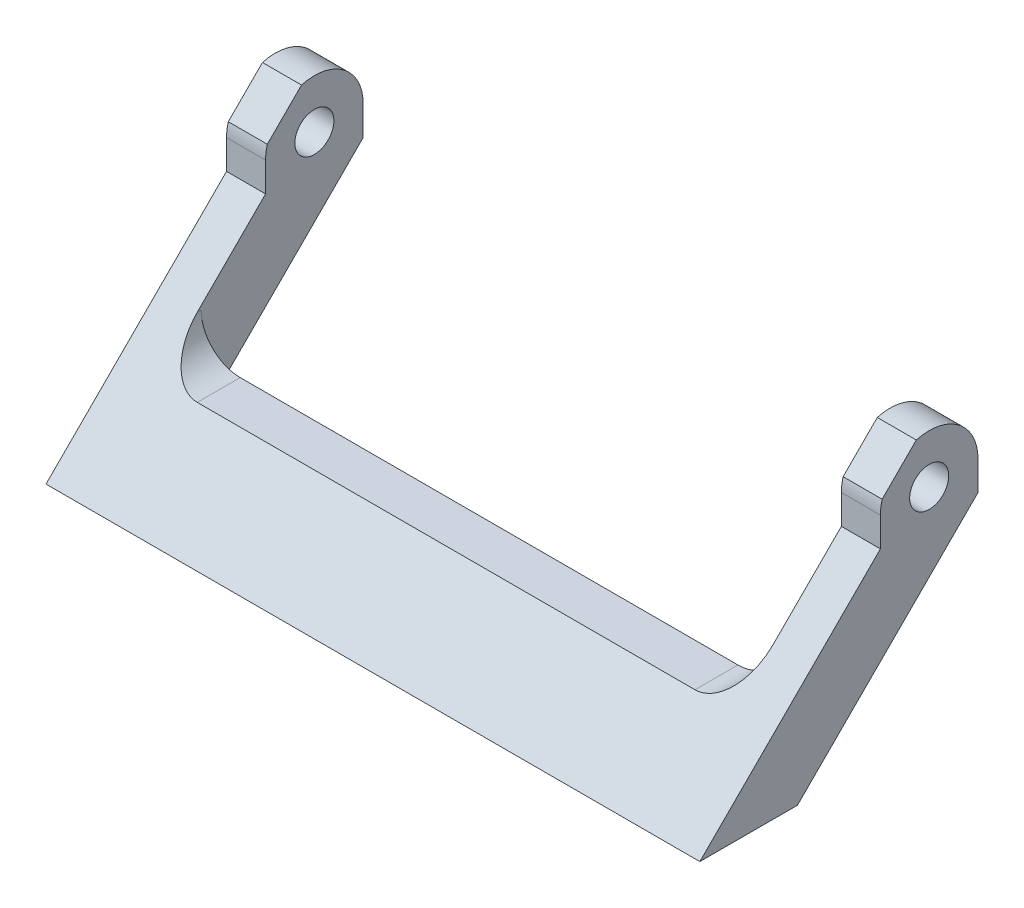
ISO-10303-21;
HEADER;
FILE_DESCRIPTION(('STEP AP214'),'2;1');
FILE_NAME('part.step','',(''),(''),'','','');
FILE_SCHEMA(('AUTOMOTIVE_DESIGN { 1 0 10303 214 1 1 1 1 }'));
ENDSEC;
DATA;
#1=APPLICATION_CONTEXT('core data for automotive mechanical design processes');
#2=APPLICATION_PROTOCOL_DEFINITION('international standard','automotive_design',2000,#1);
#3=PRODUCT_CONTEXT('',#1,'mechanical');
#4=PRODUCT('Part','Part','',(#3));
#5=PRODUCT_RELATED_PRODUCT_CATEGORY('part','',(#4));
#6=PRODUCT_DEFINITION_FORMATION('','',#4);
#7=PRODUCT_DEFINITION_CONTEXT('part definition',#1,'design');
#8=PRODUCT_DEFINITION('design','',#6,#7);
#9=PRODUCT_DEFINITION_SHAPE('','',#8);
#10=(LENGTH_UNIT() NAMED_UNIT(*) SI_UNIT(.MILLI.,.METRE.));
#11=(NAMED_UNIT(*) PLANE_ANGLE_UNIT() SI_UNIT($,.RADIAN.));
#12=(NAMED_UNIT(*) SI_UNIT($,.STERADIAN.) SOLID_ANGLE_UNIT());
#13=UNCERTAINTY_MEASURE_WITH_UNIT(LENGTH_MEASURE(1.E-05),#10,'distance_accuracy_value','');
#14=(GEOMETRIC_REPRESENTATION_CONTEXT(3) GLOBAL_UNCERTAINTY_ASSIGNED_CONTEXT((#13)) GLOBAL_UNIT_ASSIGNED_CONTEXT((#10,
#11,#12)) REPRESENTATION_CONTEXT('',''));
#15=CARTESIAN_POINT('',(0.,0.,0.));
#16=DIRECTION('',(0.,0.,1.));
#17=DIRECTION('',(1.,0.,0.));
#18=AXIS2_PLACEMENT_3D('',#15,#16,#17);
#19=CARTESIAN_POINT('',(67.,21.5,-23.5000000000002));
#20=DIRECTION('',(-1.,0.,0.));
#21=DIRECTION('',(0.,0.,1.));
#22=AXIS2_PLACEMENT_3D('',#19,#20,#21);
#23=CYLINDRICAL_SURFACE('',#22,5.);
#24=DIRECTION('',(-1.,0.,0.));
#25=VECTOR('',#24,1.);
#26=CARTESIAN_POINT('',(67.,26.3227933882397,-22.1806577645087));
#27=LINE('',#26,#25);
#28=CARTESIAN_POINT('',(4.,26.3227933882397,-22.1806577645088));
#29=VERTEX_POINT('',#28);
#30=CARTESIAN_POINT('',(0.,26.3227933882397,-22.1806577645087));
#31=VERTEX_POINT('',#30);
#32=EDGE_CURVE('E281',#29,#31,#27,.T.);
#33=ORIENTED_EDGE('',*,*,#32,.F.);
#34=CARTESIAN_POINT('',(4.,21.5,-23.5000000000002));
#35=DIRECTION('',(-1.,0.,0.));
#36=DIRECTION('',(0.,-1.,0.));
#37=AXIS2_PLACEMENT_3D('',#34,#35,#36);
#38=CIRCLE('',#37,5.);
#39=CARTESIAN_POINT('',(4.,21.5,-28.5000000000002));
#40=VERTEX_POINT('',#39);
#41=EDGE_CURVE('E283',#40,#29,#38,.F.);
#42=ORIENTED_EDGE('',*,*,#41,.F.);
#43=DIRECTION('',(-1.,0.,0.));
#44=VECTOR('',#43,1.);
#45=CARTESIAN_POINT('',(67.,21.5,-28.5000000000002));
#46=LINE('',#45,#44);
#47=CARTESIAN_POINT('',(0.,21.5,-28.5000000000002));
#48=VERTEX_POINT('',#47);
#49=EDGE_CURVE('E226',#40,#48,#46,.T.);
#50=ORIENTED_EDGE('',*,*,#49,.T.);
#51=CARTESIAN_POINT('',(0.,21.5,-23.5000000000002));
#52=DIRECTION('',(1.,0.,0.));
#53=DIRECTION('',(0.,0.,1.));
#54=AXIS2_PLACEMENT_3D('',#51,#52,#53);
#55=CIRCLE('',#54,5.);
#56=EDGE_CURVE('E204',#48,#31,#55,.T.);
#57=ORIENTED_EDGE('',*,*,#56,.T.);
#58=EDGE_LOOP('',(#33,#42,#50,#57));
#59=FACE_BOUND('',#58,.T.);
#60=ADVANCED_FACE('F33',(#59),#23,.T.);
#61=DIRECTION('',(-1.,0.,0.));
#62=VECTOR('',#61,1.);
#63=CARTESIAN_POINT('',(67.,22.8193422354914,-18.6772066117605));
#64=LINE('',#63,#62);
#65=CARTESIAN_POINT('',(0.,22.8193422354914,-18.6772066117605));
#66=VERTEX_POINT('',#65);
#67=CARTESIAN_POINT('',(4.,22.8193422354914,-18.6772066117605));
#68=VERTEX_POINT('',#67);
#69=EDGE_CURVE('E48',#66,#68,#64,.F.);
#70=ORIENTED_EDGE('',*,*,#69,.F.);
#71=CARTESIAN_POINT('',(0.,21.5,-18.5000000000002));
#72=VERTEX_POINT('',#71);
#73=EDGE_CURVE('E203',#66,#72,#55,.T.);
#74=ORIENTED_EDGE('',*,*,#73,.T.);
#75=DIRECTION('',(-1.,0.,0.));
#76=VECTOR('',#75,1.);
#77=CARTESIAN_POINT('',(67.,21.5,-18.5000000000002));
#78=LINE('',#77,#76);
#79=CARTESIAN_POINT('',(4.,21.5,-18.5000000000002));
#80=VERTEX_POINT('',#79);
#81=EDGE_CURVE('E222',#80,#72,#78,.T.);
#82=ORIENTED_EDGE('',*,*,#81,.F.);
#83=EDGE_CURVE('E276',#68,#80,#38,.F.);
#84=ORIENTED_EDGE('',*,*,#83,.F.);
#85=EDGE_LOOP('',(#70,#74,#82,#84));
#86=FACE_BOUND('',#85,.T.);
#87=ADVANCED_FACE('F275',(#86),#23,.T.);
#88=CARTESIAN_POINT('',(67.,21.5,-23.5000000000002));
#89=DIRECTION('',(-1.,0.,0.));
#90=DIRECTION('',(0.,0.,1.));
#91=AXIS2_PLACEMENT_3D('',#88,#89,#90);
#92=PLANE('',#91);
#93=CARTESIAN_POINT('',(67.,21.5,-23.5000000000002));
#94=DIRECTION('',(1.,0.,0.));
#95=DIRECTION('',(0.,0.,-1.));
#96=AXIS2_PLACEMENT_3D('',#93,#94,#95);
#97=CIRCLE('',#96,2.00000000000001);
#98=CARTESIAN_POINT('',(67.,21.5,-25.5000000000002));
#99=VERTEX_POINT('',#98);
#100=EDGE_CURVE('E200',#99,#99,#97,.T.);
#101=ORIENTED_EDGE('',*,*,#100,.F.);
#102=EDGE_LOOP('',(#101));
#103=FACE_BOUND('',#102,.T.);
#104=DIRECTION('',(0.,0.,-1.));
#105=VECTOR('',#104,1.);
#106=CARTESIAN_POINT('',(67.,0.,-11.9));
#107=LINE('',#106,#105);
#108=CARTESIAN_POINT('',(67.,0.,0.));
#109=VERTEX_POINT('',#108);
#110=CARTESIAN_POINT('',(67.,0.,-10.));
#111=VERTEX_POINT('',#110);
#112=EDGE_CURVE('E193',#109,#111,#107,.T.);
#113=ORIENTED_EDGE('',*,*,#112,.T.);
#114=DIRECTION('',(0.,0.707106781186544,-0.707106781186551));
#115=VECTOR('',#114,1.);
#116=CARTESIAN_POINT('',(67.,18.5,-28.5000000000002));
#117=LINE('',#116,#115);
#118=CARTESIAN_POINT('',(67.,18.5,-28.5000000000002));
#119=VERTEX_POINT('',#118);
#120=EDGE_CURVE('E215',#111,#119,#117,.T.);
#121=ORIENTED_EDGE('',*,*,#120,.T.);
#122=DIRECTION('',(0.,1.,0.));
#123=VECTOR('',#122,1.);
#124=CARTESIAN_POINT('',(67.,21.5,-28.5000000000002));
#125=LINE('',#124,#123);
#126=CARTESIAN_POINT('',(67.,21.5,-28.5000000000002));
#127=VERTEX_POINT('',#126);
#128=EDGE_CURVE('E182',#119,#127,#125,.T.);
#129=ORIENTED_EDGE('',*,*,#128,.T.);
#130=CARTESIAN_POINT('',(67.,21.5,-23.5000000000002));
#131=DIRECTION('',(1.,0.,0.));
#132=DIRECTION('',(0.,0.,1.));
#133=AXIS2_PLACEMENT_3D('',#130,#131,#132);
#134=CIRCLE('',#133,5.);
#135=CARTESIAN_POINT('',(67.,26.3227933882397,-22.1806577645087));
#136=VERTEX_POINT('',#135);
#137=EDGE_CURVE('E175',#127,#136,#134,.T.);
#138=ORIENTED_EDGE('',*,*,#137,.T.);
#139=DIRECTION('',(0.,-0.707106781186547,0.707106781186547));
#140=VECTOR('',#139,1.);
#141=CARTESIAN_POINT('',(67.,30.538773868803,-26.396638245072));
#142=LINE('',#141,#140);
#143=CARTESIAN_POINT('',(67.,22.8193422354914,-18.6772066117605));
#144=VERTEX_POINT('',#143);
#145=EDGE_CURVE('E161',#136,#144,#142,.T.);
#146=ORIENTED_EDGE('',*,*,#145,.T.);
#147=CARTESIAN_POINT('',(67.,21.5,-18.5000000000002));
#148=VERTEX_POINT('',#147);
#149=EDGE_CURVE('E185',#144,#148,#134,.T.);
#150=ORIENTED_EDGE('',*,*,#149,.T.);
#151=DIRECTION('',(0.,-1.,0.));
#152=VECTOR('',#151,1.);
#153=CARTESIAN_POINT('',(67.,18.5,-18.5000000000002));
#154=LINE('',#153,#152);
#155=CARTESIAN_POINT('',(67.,18.5,-18.5000000000002));
#156=VERTEX_POINT('',#155);
#157=EDGE_CURVE('E184',#148,#156,#154,.T.);
#158=ORIENTED_EDGE('',*,*,#157,.T.);
#159=DIRECTION('',(0.,-0.707106781186544,0.707106781186551));
#160=VECTOR('',#159,1.);
#161=CARTESIAN_POINT('',(67.,0.,0.));
#162=LINE('',#161,#160);
#163=EDGE_CURVE('E187',#156,#109,#162,.T.);
#164=ORIENTED_EDGE('',*,*,#163,.T.);
#165=EDGE_LOOP('',(#113,#121,#129,#138,#146,#150,#158,#164));
#166=FACE_BOUND('',#165,.T.);
#167=ADVANCED_FACE('F180',(#103,#166),#92,.F.);
#168=CARTESIAN_POINT('',(0.,21.5,-23.5000000000002));
#169=DIRECTION('',(-1.,0.,0.));
#170=DIRECTION('',(0.,0.,1.));
#171=AXIS2_PLACEMENT_3D('',#168,#169,#170);
#172=PLANE('',#171);
#173=CARTESIAN_POINT('',(0.,21.5,-23.5000000000002));
#174=DIRECTION('',(1.,0.,0.));
#175=DIRECTION('',(0.,0.,-1.));
#176=AXIS2_PLACEMENT_3D('',#173,#174,#175);
#177=CIRCLE('',#176,2.00000000000001);
#178=CARTESIAN_POINT('',(0.,21.5,-25.5000000000002));
#179=VERTEX_POINT('',#178);
#180=EDGE_CURVE('E329',#179,#179,#177,.T.);
#181=ORIENTED_EDGE('',*,*,#180,.T.);
#182=EDGE_LOOP('',(#181));
#183=FACE_BOUND('',#182,.T.);
#184=DIRECTION('',(0.,0.707106781186544,-0.707106781186551));
#185=VECTOR('',#184,1.);
#186=CARTESIAN_POINT('',(0.,18.5,-28.5000000000002));
#187=LINE('',#186,#185);
#188=CARTESIAN_POINT('',(0.,0.,-10.));
#189=VERTEX_POINT('',#188);
#190=CARTESIAN_POINT('',(0.,18.5,-28.5000000000002));
#191=VERTEX_POINT('',#190);
#192=EDGE_CURVE('E196',#189,#191,#187,.T.);
#193=ORIENTED_EDGE('',*,*,#192,.F.);
#194=DIRECTION('',(0.,0.,-1.));
#195=VECTOR('',#194,1.);
#196=CARTESIAN_POINT('',(0.,0.,-11.9));
#197=LINE('',#196,#195);
#198=CARTESIAN_POINT('',(0.,0.,0.));
#199=VERTEX_POINT('',#198);
#200=EDGE_CURVE('E212',#199,#189,#197,.T.);
#201=ORIENTED_EDGE('',*,*,#200,.F.);
#202=DIRECTION('',(0.,-0.707106781186544,0.707106781186551));
#203=VECTOR('',#202,1.);
#204=CARTESIAN_POINT('',(0.,0.,0.));
#205=LINE('',#204,#203);
#206=CARTESIAN_POINT('',(0.,18.5,-18.5000000000002));
#207=VERTEX_POINT('',#206);
#208=EDGE_CURVE('E210',#207,#199,#205,.T.);
#209=ORIENTED_EDGE('',*,*,#208,.F.);
#210=DIRECTION('',(0.,-1.,0.));
#211=VECTOR('',#210,1.);
#212=CARTESIAN_POINT('',(0.,18.5,-18.5000000000002));
#213=LINE('',#212,#211);
#214=EDGE_CURVE('E207',#72,#207,#213,.T.);
#215=ORIENTED_EDGE('',*,*,#214,.F.);
#216=ORIENTED_EDGE('',*,*,#73,.F.);
#217=DIRECTION('',(0.,-0.707106781186547,0.707106781186547));
#218=VECTOR('',#217,1.);
#219=CARTESIAN_POINT('',(0.,30.538773868803,-26.396638245072));
#220=LINE('',#219,#218);
#221=EDGE_CURVE('E168',#31,#66,#220,.T.);
#222=ORIENTED_EDGE('',*,*,#221,.F.);
#223=ORIENTED_EDGE('',*,*,#56,.F.);
#224=DIRECTION('',(0.,1.,0.));
#225=VECTOR('',#224,1.);
#226=CARTESIAN_POINT('',(0.,21.5,-28.5000000000002));
#227=LINE('',#226,#225);
#228=EDGE_CURVE('E199',#191,#48,#227,.T.);
#229=ORIENTED_EDGE('',*,*,#228,.F.);
#230=EDGE_LOOP('',(#193,#201,#209,#215,#216,#222,#223,#229));
#231=FACE_BOUND('',#230,.T.);
#232=ADVANCED_FACE('F244',(#183,#231),#172,.T.);
#233=DIRECTION('',(-1.,0.,0.));
#234=VECTOR('',#233,1.);
#235=CARTESIAN_POINT('',(67.,26.3227933882397,-22.1806577645087));
#236=LINE('',#235,#234);
#237=CARTESIAN_POINT('',(63.,26.3227933882397,-22.1806577645087));
#238=VERTEX_POINT('',#237);
#239=EDGE_CURVE('E55',#136,#238,#236,.T.);
#240=ORIENTED_EDGE('',*,*,#239,.F.);
#241=ORIENTED_EDGE('',*,*,#137,.F.);
#242=CARTESIAN_POINT('',(63.,21.5,-28.5000000000002));
#243=VERTEX_POINT('',#242);
#244=EDGE_CURVE('E227',#127,#243,#46,.T.);
#245=ORIENTED_EDGE('',*,*,#244,.T.);
#246=CARTESIAN_POINT('',(63.,21.5,-23.5000000000002));
#247=DIRECTION('',(1.,0.,0.));
#248=DIRECTION('',(0.,0.,-1.));
#249=AXIS2_PLACEMENT_3D('',#246,#247,#248);
#250=CIRCLE('',#249,5.);
#251=EDGE_CURVE('E176',#238,#243,#250,.F.);
#252=ORIENTED_EDGE('',*,*,#251,.F.);
#253=EDGE_LOOP('',(#240,#241,#245,#252));
#254=FACE_BOUND('',#253,.T.);
#255=ADVANCED_FACE('F173',(#254),#23,.T.);
#256=DIRECTION('',(-1.,0.,0.));
#257=VECTOR('',#256,1.);
#258=CARTESIAN_POINT('',(67.,22.8193422354914,-18.6772066117605));
#259=LINE('',#258,#257);
#260=CARTESIAN_POINT('',(63.,22.8193422354914,-18.6772066117605));
#261=VERTEX_POINT('',#260);
#262=EDGE_CURVE('E164',#261,#144,#259,.F.);
#263=ORIENTED_EDGE('',*,*,#262,.F.);
#264=CARTESIAN_POINT('',(63.,21.5,-18.5000000000002));
#265=VERTEX_POINT('',#264);
#266=EDGE_CURVE('E290',#265,#261,#250,.F.);
#267=ORIENTED_EDGE('',*,*,#266,.F.);
#268=EDGE_CURVE('E223',#148,#265,#78,.T.);
#269=ORIENTED_EDGE('',*,*,#268,.F.);
#270=ORIENTED_EDGE('',*,*,#149,.F.);
#271=EDGE_LOOP('',(#263,#267,#269,#270));
#272=FACE_BOUND('',#271,.T.);
#273=ADVANCED_FACE('F355',(#272),#23,.T.);
#274=CARTESIAN_POINT('',(67.,0.,-11.9));
#275=DIRECTION('',(0.,1.,0.));
#276=DIRECTION('',(0.,0.,1.));
#277=AXIS2_PLACEMENT_3D('',#274,#275,#276);
#278=PLANE('',#277);
#279=DIRECTION('',(-1.,0.,0.));
#280=VECTOR('',#279,1.);
#281=CARTESIAN_POINT('',(67.,0.,-10.));
#282=LINE('',#281,#280);
#283=EDGE_CURVE('E249',#111,#189,#282,.T.);
#284=ORIENTED_EDGE('',*,*,#283,.F.);
#285=ORIENTED_EDGE('',*,*,#112,.F.);
#286=DIRECTION('',(-1.,0.,0.));
#287=VECTOR('',#286,1.);
#288=CARTESIAN_POINT('',(67.,0.,0.));
#289=LINE('',#288,#287);
#290=EDGE_CURVE('E195',#109,#199,#289,.T.);
#291=ORIENTED_EDGE('',*,*,#290,.T.);
#292=ORIENTED_EDGE('',*,*,#200,.T.);
#293=EDGE_LOOP('',(#284,#285,#291,#292));
#294=FACE_BOUND('',#293,.T.);
#295=ADVANCED_FACE('F255',(#294),#278,.F.);
#296=CARTESIAN_POINT('',(67.,1.9,-11.9));
#297=DIRECTION('',(0.,0.,1.));
#298=DIRECTION('',(1.,0.,0.));
#299=AXIS2_PLACEMENT_3D('',#296,#297,#298);
#300=PLANE('',#299);
#301=DIRECTION('',(1.,0.,0.));
#302=VECTOR('',#301,1.);
#303=CARTESIAN_POINT('',(67.,1.9,-11.9));
#304=LINE('',#303,#302);
#305=CARTESIAN_POINT('',(4.,1.9,-11.9));
#306=VERTEX_POINT('',#305);
#307=CARTESIAN_POINT('',(63.,1.9,-11.9));
#308=VERTEX_POINT('',#307);
#309=EDGE_CURVE('E253',#306,#308,#304,.T.);
#310=ORIENTED_EDGE('',*,*,#309,.F.);
#311=DIRECTION('',(0.,-1.,0.));
#312=VECTOR('',#311,1.);
#313=CARTESIAN_POINT('',(3.99999999999998,26.501,-11.9));
#314=LINE('',#313,#312);
#315=CARTESIAN_POINT('',(3.99999999999998,11.5,-11.9));
#316=VERTEX_POINT('',#315);
#317=EDGE_CURVE('E342',#316,#306,#314,.T.);
#318=ORIENTED_EDGE('',*,*,#317,.F.);
#319=CARTESIAN_POINT('',(8.,11.5,-11.9));
#320=DIRECTION('',(0.,0.,1.));
#321=DIRECTION('',(0.,-1.,0.));
#322=AXIS2_PLACEMENT_3D('',#319,#320,#321);
#323=CIRCLE('',#322,4.);
#324=CARTESIAN_POINT('',(8.00000000000003,7.5,-11.9));
#325=VERTEX_POINT('',#324);
#326=EDGE_CURVE('E343',#316,#325,#323,.T.);
#327=ORIENTED_EDGE('',*,*,#326,.T.);
#328=DIRECTION('',(1.,0.,0.));
#329=VECTOR('',#328,1.);
#330=CARTESIAN_POINT('',(3.99999999999998,7.5,-11.9));
#331=LINE('',#330,#329);
#332=CARTESIAN_POINT('',(59.,7.5,-11.9));
#333=VERTEX_POINT('',#332);
#334=EDGE_CURVE('E346',#325,#333,#331,.T.);
#335=ORIENTED_EDGE('',*,*,#334,.T.);
#336=CARTESIAN_POINT('',(59.,11.5,-11.9));
#337=DIRECTION('',(0.,0.,1.));
#338=DIRECTION('',(0.,-1.,0.));
#339=AXIS2_PLACEMENT_3D('',#336,#337,#338);
#340=CIRCLE('',#339,4.);
#341=CARTESIAN_POINT('',(63.,11.5,-11.9));
#342=VERTEX_POINT('',#341);
#343=EDGE_CURVE('E252',#333,#342,#340,.T.);
#344=ORIENTED_EDGE('',*,*,#343,.T.);
#345=DIRECTION('',(0.,-1.,0.));
#346=VECTOR('',#345,1.);
#347=CARTESIAN_POINT('',(63.,26.501,-11.9));
#348=LINE('',#347,#346);
#349=EDGE_CURVE('E338',#342,#308,#348,.T.);
#350=ORIENTED_EDGE('',*,*,#349,.T.);
#351=EDGE_LOOP('',(#310,#318,#327,#335,#344,#350));
#352=FACE_BOUND('',#351,.T.);
#353=ADVANCED_FACE('F340',(#352),#300,.F.);
#354=CARTESIAN_POINT('',(4.,11.5,0.001000000000001));
#355=DIRECTION('',(-1.,0.,0.));
#356=DIRECTION('',(0.,-1.,0.));
#357=AXIS2_PLACEMENT_3D('',#354,#355,#356);
#358=PLANE('',#357);
#359=CARTESIAN_POINT('',(4.,21.5,-23.5000000000002));
#360=DIRECTION('',(-1.,0.,0.));
#361=DIRECTION('',(0.,-1.,0.));
#362=AXIS2_PLACEMENT_3D('',#359,#360,#361);
#363=CIRCLE('',#362,2.00000000000001);
#364=CARTESIAN_POINT('',(4.,19.5,-23.5000000000002));
#365=VERTEX_POINT('',#364);
#366=EDGE_CURVE('E296',#365,#365,#363,.F.);
#367=ORIENTED_EDGE('',*,*,#366,.F.);
#368=EDGE_LOOP('',(#367));
#369=FACE_BOUND('',#368,.T.);
#370=DIRECTION('',(0.,0.707106781186547,-0.707106781186548));
#371=VECTOR('',#370,1.);
#372=CARTESIAN_POINT('',(4.,7.82056781186549,-3.67843218813454));
#373=LINE('',#372,#371);
#374=EDGE_CURVE('E177',#68,#29,#373,.T.);
#375=ORIENTED_EDGE('',*,*,#374,.F.);
#376=ORIENTED_EDGE('',*,*,#83,.T.);
#377=DIRECTION('',(0.,-1.,0.));
#378=VECTOR('',#377,1.);
#379=CARTESIAN_POINT('',(4.,11.5,-18.5000000000002));
#380=LINE('',#379,#378);
#381=CARTESIAN_POINT('',(4.,18.5,-18.5000000000002));
#382=VERTEX_POINT('',#381);
#383=EDGE_CURVE('E272',#80,#382,#380,.T.);
#384=ORIENTED_EDGE('',*,*,#383,.T.);
#385=DIRECTION('',(0.,-0.707106781186544,0.707106781186551));
#386=VECTOR('',#385,1.);
#387=CARTESIAN_POINT('',(4.,5.74949999999996,-5.74950000000001));
#388=LINE('',#387,#386);
#389=CARTESIAN_POINT('',(4.,11.5,-11.5000000000001));
#390=VERTEX_POINT('',#389);
#391=EDGE_CURVE('E266',#382,#390,#388,.T.);
#392=ORIENTED_EDGE('',*,*,#391,.T.);
#393=DIRECTION('',(0.,0.,-1.));
#394=VECTOR('',#393,1.);
#395=CARTESIAN_POINT('',(4.,11.5,0.001000000000001));
#396=LINE('',#395,#394);
#397=EDGE_CURVE('E312',#390,#316,#396,.T.);
#398=ORIENTED_EDGE('',*,*,#397,.T.);
#399=ORIENTED_EDGE('',*,*,#317,.T.);
#400=DIRECTION('',(0.,0.707106781186544,-0.707106781186551));
#401=VECTOR('',#400,1.);
#402=CARTESIAN_POINT('',(4.,0.749499999999965,-10.7495));
#403=LINE('',#402,#401);
#404=CARTESIAN_POINT('',(4.,18.5,-28.5000000000002));
#405=VERTEX_POINT('',#404);
#406=EDGE_CURVE('E288',#306,#405,#403,.T.);
#407=ORIENTED_EDGE('',*,*,#406,.T.);
#408=DIRECTION('',(0.,1.,0.));
#409=VECTOR('',#408,1.);
#410=CARTESIAN_POINT('',(4.,11.5,-28.5000000000002));
#411=LINE('',#410,#409);
#412=EDGE_CURVE('E240',#405,#40,#411,.T.);
#413=ORIENTED_EDGE('',*,*,#412,.T.);
#414=ORIENTED_EDGE('',*,*,#41,.T.);
#415=EDGE_LOOP('',(#375,#376,#384,#392,#398,#399,#407,#413,#414));
#416=FACE_BOUND('',#415,.T.);
#417=ADVANCED_FACE('F373',(#369,#416),#358,.F.);
#418=CARTESIAN_POINT('',(63.,26.5,0.001000000000001));
#419=DIRECTION('',(1.,0.,0.));
#420=DIRECTION('',(0.,0.,-1.));
#421=AXIS2_PLACEMENT_3D('',#418,#419,#420);
#422=PLANE('',#421);
#423=CARTESIAN_POINT('',(63.,21.5,-23.5000000000002));
#424=DIRECTION('',(1.,0.,0.));
#425=DIRECTION('',(0.,0.,-1.));
#426=AXIS2_PLACEMENT_3D('',#423,#424,#425);
#427=CIRCLE('',#426,2.00000000000001);
#428=CARTESIAN_POINT('',(63.,21.5,-25.5000000000002));
#429=VERTEX_POINT('',#428);
#430=EDGE_CURVE('E295',#429,#429,#427,.F.);
#431=ORIENTED_EDGE('',*,*,#430,.F.);
#432=EDGE_LOOP('',(#431));
#433=FACE_BOUND('',#432,.T.);
#434=DIRECTION('',(0.,-0.707106781186547,0.707106781186548));
#435=VECTOR('',#434,1.);
#436=CARTESIAN_POINT('',(63.,15.3205678118655,-11.1784321881345));
#437=LINE('',#436,#435);
#438=EDGE_CURVE('E12',#238,#261,#437,.T.);
#439=ORIENTED_EDGE('',*,*,#438,.F.);
#440=ORIENTED_EDGE('',*,*,#251,.T.);
#441=DIRECTION('',(0.,-1.,0.));
#442=VECTOR('',#441,1.);
#443=CARTESIAN_POINT('',(63.,26.5,-28.5000000000002));
#444=LINE('',#443,#442);
#445=CARTESIAN_POINT('',(63.,18.5,-28.5000000000002));
#446=VERTEX_POINT('',#445);
#447=EDGE_CURVE('E308',#243,#446,#444,.T.);
#448=ORIENTED_EDGE('',*,*,#447,.T.);
#449=DIRECTION('',(0.,-0.707106781186544,0.707106781186551));
#450=VECTOR('',#449,1.);
#451=CARTESIAN_POINT('',(63.,8.24949999999988,-18.2494999999999));
#452=LINE('',#451,#450);
#453=EDGE_CURVE('E285',#446,#308,#452,.T.);
#454=ORIENTED_EDGE('',*,*,#453,.T.);
#455=ORIENTED_EDGE('',*,*,#349,.F.);
#456=DIRECTION('',(0.,0.,-1.));
#457=VECTOR('',#456,1.);
#458=CARTESIAN_POINT('',(63.,11.5,0.001000000000001));
#459=LINE('',#458,#457);
#460=CARTESIAN_POINT('',(63.,11.5,-11.5000000000001));
#461=VERTEX_POINT('',#460);
#462=EDGE_CURVE('E311',#461,#342,#459,.T.);
#463=ORIENTED_EDGE('',*,*,#462,.F.);
#464=DIRECTION('',(0.,0.707106781186544,-0.707106781186551));
#465=VECTOR('',#464,1.);
#466=CARTESIAN_POINT('',(63.,13.2494999999999,-13.2495));
#467=LINE('',#466,#465);
#468=CARTESIAN_POINT('',(63.,18.5,-18.5000000000002));
#469=VERTEX_POINT('',#468);
#470=EDGE_CURVE('E315',#461,#469,#467,.T.);
#471=ORIENTED_EDGE('',*,*,#470,.T.);
#472=DIRECTION('',(0.,1.,0.));
#473=VECTOR('',#472,1.);
#474=CARTESIAN_POINT('',(63.,26.5,-18.5000000000002));
#475=LINE('',#474,#473);
#476=EDGE_CURVE('E327',#469,#265,#475,.T.);
#477=ORIENTED_EDGE('',*,*,#476,.T.);
#478=ORIENTED_EDGE('',*,*,#266,.T.);
#479=EDGE_LOOP('',(#439,#440,#448,#454,#455,#463,#471,#477,#478));
#480=FACE_BOUND('',#479,.T.);
#481=ADVANCED_FACE('F337',(#433,#480),#422,.F.);
#482=CARTESIAN_POINT('',(67.,21.5,-28.5000000000002));
#483=DIRECTION('',(0.,0.,1.));
#484=DIRECTION('',(1.,0.,0.));
#485=AXIS2_PLACEMENT_3D('',#482,#483,#484);
#486=PLANE('',#485);
#487=ORIENTED_EDGE('',*,*,#49,.F.);
#488=ORIENTED_EDGE('',*,*,#412,.F.);
#489=DIRECTION('',(-1.,0.,0.));
#490=VECTOR('',#489,1.);
#491=CARTESIAN_POINT('',(67.,18.5,-28.5000000000002));
#492=LINE('',#491,#490);
#493=EDGE_CURVE('E228',#405,#191,#492,.T.);
#494=ORIENTED_EDGE('',*,*,#493,.T.);
#495=ORIENTED_EDGE('',*,*,#228,.T.);
#496=EDGE_LOOP('',(#487,#488,#494,#495));
#497=FACE_BOUND('',#496,.T.);
#498=ADVANCED_FACE('F238',(#497),#486,.F.);
#499=CARTESIAN_POINT('',(67.,18.5,-18.5000000000002));
#500=DIRECTION('',(0.,0.,-1.));
#501=DIRECTION('',(-1.,0.,0.));
#502=AXIS2_PLACEMENT_3D('',#499,#500,#501);
#503=PLANE('',#502);
#504=DIRECTION('',(-1.,0.,0.));
#505=VECTOR('',#504,1.);
#506=CARTESIAN_POINT('',(67.,18.5,-18.5000000000002));
#507=LINE('',#506,#505);
#508=EDGE_CURVE('E218',#382,#207,#507,.T.);
#509=ORIENTED_EDGE('',*,*,#508,.F.);
#510=ORIENTED_EDGE('',*,*,#383,.F.);
#511=ORIENTED_EDGE('',*,*,#81,.T.);
#512=ORIENTED_EDGE('',*,*,#214,.T.);
#513=EDGE_LOOP('',(#509,#510,#511,#512));
#514=FACE_BOUND('',#513,.T.);
#515=ADVANCED_FACE('F270',(#514),#503,.F.);
#516=CARTESIAN_POINT('',(67.,21.5,-23.5000000000002));
#517=DIRECTION('',(-1.,0.,0.));
#518=DIRECTION('',(0.,0.,1.));
#519=AXIS2_PLACEMENT_3D('',#516,#517,#518);
#520=CYLINDRICAL_SURFACE('',#519,2.00000000000001);
#521=ORIENTED_EDGE('',*,*,#366,.T.);
#522=EDGE_LOOP('',(#521));
#523=FACE_BOUND('',#522,.T.);
#524=ORIENTED_EDGE('',*,*,#180,.F.);
#525=EDGE_LOOP('',(#524));
#526=FACE_BOUND('',#525,.T.);
#527=ADVANCED_FACE('F422',(#523,#526),#520,.F.);
#528=CARTESIAN_POINT('',(67.,18.5,-28.5000000000002));
#529=DIRECTION('',(0.,0.707106781186551,0.707106781186544));
#530=DIRECTION('',(0.,-0.707106781186544,0.707106781186551));
#531=AXIS2_PLACEMENT_3D('',#528,#529,#530);
#532=PLANE('',#531);
#533=ORIENTED_EDGE('',*,*,#120,.F.);
#534=ORIENTED_EDGE('',*,*,#283,.T.);
#535=ORIENTED_EDGE('',*,*,#192,.T.);
#536=ORIENTED_EDGE('',*,*,#493,.F.);
#537=ORIENTED_EDGE('',*,*,#406,.F.);
#538=ORIENTED_EDGE('',*,*,#309,.T.);
#539=ORIENTED_EDGE('',*,*,#453,.F.);
#540=EDGE_CURVE('E41',#119,#446,#492,.T.);
#541=ORIENTED_EDGE('',*,*,#540,.F.);
#542=EDGE_LOOP('',(#533,#534,#535,#536,#537,#538,#539,#541));
#543=FACE_BOUND('',#542,.T.);
#544=ADVANCED_FACE('F35',(#543),#532,.F.);
#545=ORIENTED_EDGE('',*,*,#540,.T.);
#546=ORIENTED_EDGE('',*,*,#447,.F.);
#547=ORIENTED_EDGE('',*,*,#244,.F.);
#548=ORIENTED_EDGE('',*,*,#128,.F.);
#549=EDGE_LOOP('',(#545,#546,#547,#548));
#550=FACE_BOUND('',#549,.T.);
#551=ADVANCED_FACE('F417',(#550),#486,.F.);
#552=ORIENTED_EDGE('',*,*,#268,.T.);
#553=ORIENTED_EDGE('',*,*,#476,.F.);
#554=EDGE_CURVE('E219',#156,#469,#507,.T.);
#555=ORIENTED_EDGE('',*,*,#554,.F.);
#556=ORIENTED_EDGE('',*,*,#157,.F.);
#557=EDGE_LOOP('',(#552,#553,#555,#556));
#558=FACE_BOUND('',#557,.T.);
#559=ADVANCED_FACE('F358',(#558),#503,.F.);
#560=CARTESIAN_POINT('',(67.,0.,0.));
#561=DIRECTION('',(0.,-0.707106781186551,-0.707106781186544));
#562=DIRECTION('',(0.,0.707106781186544,-0.707106781186551));
#563=AXIS2_PLACEMENT_3D('',#560,#561,#562);
#564=PLANE('',#563);
#565=CARTESIAN_POINT('',(8.,11.5,-11.5000000000001));
#566=DIRECTION('',(0.,-0.707106781186551,-0.707106781186544));
#567=DIRECTION('',(0.,0.707106781186544,-0.707106781186551));
#568=AXIS2_PLACEMENT_3D('',#565,#566,#567);
#569=ELLIPSE('',#568,5.65685424949241,4.);
#570=CARTESIAN_POINT('',(8.00000000000004,7.5,-7.50000000000008));
#571=VERTEX_POINT('',#570);
#572=EDGE_CURVE('E304',#390,#571,#569,.F.);
#573=ORIENTED_EDGE('',*,*,#572,.F.);
#574=ORIENTED_EDGE('',*,*,#391,.F.);
#575=ORIENTED_EDGE('',*,*,#508,.T.);
#576=ORIENTED_EDGE('',*,*,#208,.T.);
#577=ORIENTED_EDGE('',*,*,#290,.F.);
#578=ORIENTED_EDGE('',*,*,#163,.F.);
#579=ORIENTED_EDGE('',*,*,#554,.T.);
#580=ORIENTED_EDGE('',*,*,#470,.F.);
#581=CARTESIAN_POINT('',(59.,11.5,-11.5000000000001));
#582=DIRECTION('',(0.,-0.707106781186551,-0.707106781186544));
#583=DIRECTION('',(0.,0.707106781186544,-0.707106781186551));
#584=AXIS2_PLACEMENT_3D('',#581,#582,#583);
#585=ELLIPSE('',#584,5.65685424949241,4.);
#586=CARTESIAN_POINT('',(59.,7.5,-7.50000000000007));
#587=VERTEX_POINT('',#586);
#588=EDGE_CURVE('E299',#587,#461,#585,.F.);
#589=ORIENTED_EDGE('',*,*,#588,.F.);
#590=DIRECTION('',(1.,0.,0.));
#591=VECTOR('',#590,1.);
#592=CARTESIAN_POINT('',(59.,7.5,-7.50000000000008));
#593=LINE('',#592,#591);
#594=EDGE_CURVE('E302',#571,#587,#593,.T.);
#595=ORIENTED_EDGE('',*,*,#594,.F.);
#596=EDGE_LOOP('',(#573,#574,#575,#576,#577,#578,#579,#580,#589,#595));
#597=FACE_BOUND('',#596,.T.);
#598=ADVANCED_FACE('F262',(#597),#564,.F.);
#599=ORIENTED_EDGE('',*,*,#430,.T.);
#600=EDGE_LOOP('',(#599));
#601=FACE_BOUND('',#600,.T.);
#602=ORIENTED_EDGE('',*,*,#100,.T.);
#603=EDGE_LOOP('',(#602));
#604=FACE_BOUND('',#603,.T.);
#605=ADVANCED_FACE('F415',(#601,#604),#520,.F.);
#606=CARTESIAN_POINT('',(8.,11.5,0.001000000000001));
#607=DIRECTION('',(0.,0.,-1.));
#608=DIRECTION('',(-1.,0.,0.));
#609=AXIS2_PLACEMENT_3D('',#606,#607,#608);
#610=CYLINDRICAL_SURFACE('',#609,4.);
#611=DIRECTION('',(0.,0.,-1.));
#612=VECTOR('',#611,1.);
#613=CARTESIAN_POINT('',(8.00000000000003,7.5,0.001000000000001));
#614=LINE('',#613,#612);
#615=EDGE_CURVE('E316',#571,#325,#614,.T.);
#616=ORIENTED_EDGE('',*,*,#615,.T.);
#617=ORIENTED_EDGE('',*,*,#326,.F.);
#618=ORIENTED_EDGE('',*,*,#397,.F.);
#619=ORIENTED_EDGE('',*,*,#572,.T.);
#620=EDGE_LOOP('',(#616,#617,#618,#619));
#621=FACE_BOUND('',#620,.T.);
#622=ADVANCED_FACE('F371',(#621),#610,.F.);
#623=CARTESIAN_POINT('',(59.,7.5,0.001000000000001));
#624=DIRECTION('',(0.,-1.,0.));
#625=DIRECTION('',(0.,0.,-1.));
#626=AXIS2_PLACEMENT_3D('',#623,#624,#625);
#627=PLANE('',#626);
#628=DIRECTION('',(0.,0.,-1.));
#629=VECTOR('',#628,1.);
#630=CARTESIAN_POINT('',(59.,7.5,0.001000000000001));
#631=LINE('',#630,#629);
#632=EDGE_CURVE('E319',#587,#333,#631,.T.);
#633=ORIENTED_EDGE('',*,*,#632,.T.);
#634=ORIENTED_EDGE('',*,*,#334,.F.);
#635=ORIENTED_EDGE('',*,*,#615,.F.);
#636=ORIENTED_EDGE('',*,*,#594,.T.);
#637=EDGE_LOOP('',(#633,#634,#635,#636));
#638=FACE_BOUND('',#637,.T.);
#639=ADVANCED_FACE('F367',(#638),#627,.F.);
#640=CARTESIAN_POINT('',(59.,11.5,0.001000000000001));
#641=DIRECTION('',(0.,0.,-1.));
#642=DIRECTION('',(-1.,0.,0.));
#643=AXIS2_PLACEMENT_3D('',#640,#641,#642);
#644=CYLINDRICAL_SURFACE('',#643,4.);
#645=ORIENTED_EDGE('',*,*,#462,.T.);
#646=ORIENTED_EDGE('',*,*,#343,.F.);
#647=ORIENTED_EDGE('',*,*,#632,.F.);
#648=ORIENTED_EDGE('',*,*,#588,.T.);
#649=EDGE_LOOP('',(#645,#646,#647,#648));
#650=FACE_BOUND('',#649,.T.);
#651=ADVANCED_FACE('F365',(#650),#644,.F.);
#652=CARTESIAN_POINT('',(0.,30.538773868803,-26.396638245072));
#653=DIRECTION('',(0.,0.707106781186548,0.707106781186547));
#654=DIRECTION('',(0.,-0.707106781186547,0.707106781186548));
#655=AXIS2_PLACEMENT_3D('',#652,#653,#654);
#656=PLANE('',#655);
#657=ORIENTED_EDGE('',*,*,#239,.T.);
#658=ORIENTED_EDGE('',*,*,#438,.T.);
#659=ORIENTED_EDGE('',*,*,#262,.T.);
#660=ORIENTED_EDGE('',*,*,#145,.F.);
#661=EDGE_LOOP('',(#657,#658,#659,#660));
#662=FACE_BOUND('',#661,.T.);
#663=ADVANCED_FACE('F162',(#662),#656,.T.);
#664=ORIENTED_EDGE('',*,*,#32,.T.);
#665=ORIENTED_EDGE('',*,*,#221,.T.);
#666=ORIENTED_EDGE('',*,*,#69,.T.);
#667=ORIENTED_EDGE('',*,*,#374,.T.);
#668=EDGE_LOOP('',(#664,#665,#666,#667));
#669=FACE_BOUND('',#668,.T.);
#670=ADVANCED_FACE('F380',(#669),#656,.T.);
#671=CLOSED_SHELL('',(#60,#87,#167,#232,#255,#273,#295,#353,#417,#481,#498,#515,#527,#544,#551,
#559,#598,#605,#622,#639,#651,#663,#670));
#672=MANIFOLD_SOLID_BREP('B2',#671);
#673=ADVANCED_BREP_SHAPE_REPRESENTATION('',(#18,#672),#14);
#674=SHAPE_DEFINITION_REPRESENTATION(#9,#673);
ENDSEC;
END-ISO-10303-21;
